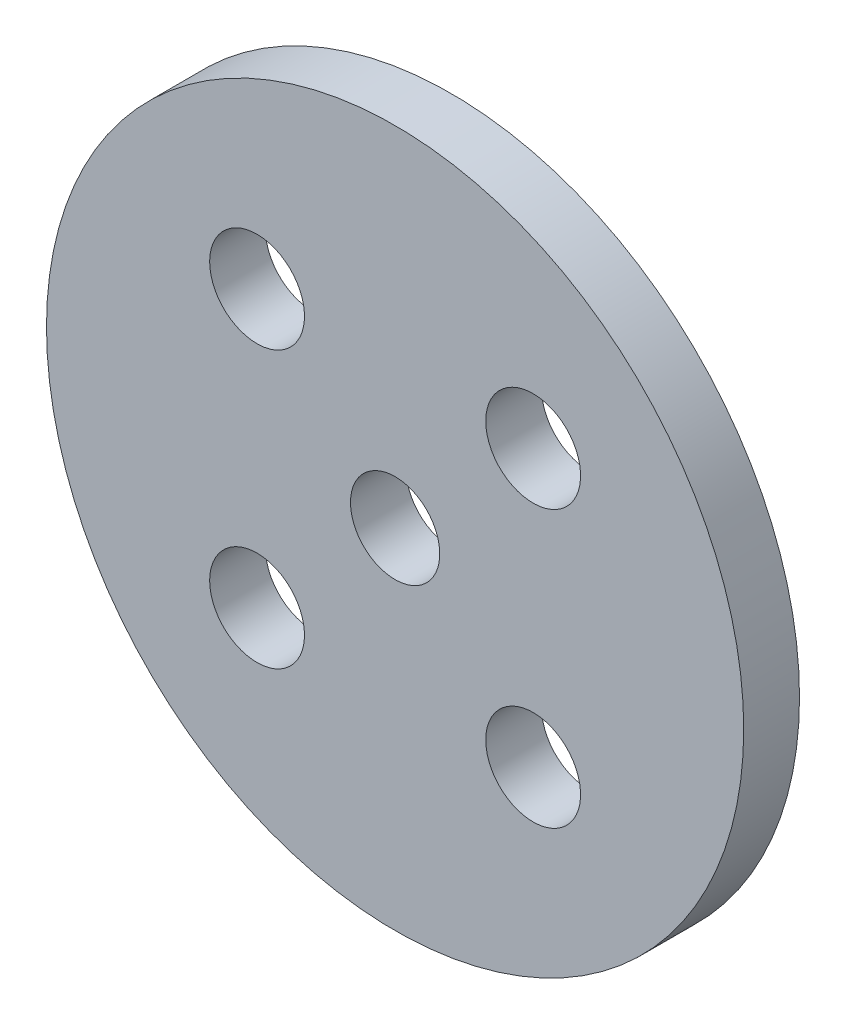
ISO-10303-21;
HEADER;
FILE_DESCRIPTION(('STEP AP214'),'2;1');
FILE_NAME('part.step','',(''),(''),'','','');
FILE_SCHEMA(('AUTOMOTIVE_DESIGN { 1 0 10303 214 1 1 1 1 }'));
ENDSEC;
DATA;
#1=APPLICATION_CONTEXT('core data for automotive mechanical design processes');
#2=APPLICATION_PROTOCOL_DEFINITION('international standard','automotive_design',2000,#1);
#3=PRODUCT_CONTEXT('',#1,'mechanical');
#4=PRODUCT('Part','Part','',(#3));
#5=PRODUCT_RELATED_PRODUCT_CATEGORY('part','',(#4));
#6=PRODUCT_DEFINITION_FORMATION('','',#4);
#7=PRODUCT_DEFINITION_CONTEXT('part definition',#1,'design');
#8=PRODUCT_DEFINITION('design','',#6,#7);
#9=PRODUCT_DEFINITION_SHAPE('','',#8);
#10=(LENGTH_UNIT() NAMED_UNIT(*) SI_UNIT(.MILLI.,.METRE.));
#11=(NAMED_UNIT(*) PLANE_ANGLE_UNIT() SI_UNIT($,.RADIAN.));
#12=(NAMED_UNIT(*) SI_UNIT($,.STERADIAN.) SOLID_ANGLE_UNIT());
#13=UNCERTAINTY_MEASURE_WITH_UNIT(LENGTH_MEASURE(1.E-05),#10,'distance_accuracy_value','');
#14=(GEOMETRIC_REPRESENTATION_CONTEXT(3) GLOBAL_UNCERTAINTY_ASSIGNED_CONTEXT((#13)) GLOBAL_UNIT_ASSIGNED_CONTEXT((#10,
#11,#12)) REPRESENTATION_CONTEXT('',''));
#15=CARTESIAN_POINT('',(0.,0.,0.));
#16=DIRECTION('',(0.,0.,1.));
#17=DIRECTION('',(1.,0.,0.));
#18=AXIS2_PLACEMENT_3D('',#15,#16,#17);
#19=CARTESIAN_POINT('',(1453.29186510434,480.003664233674,0.));
#20=DIRECTION('',(0.,0.,1.));
#21=DIRECTION('',(1.,0.,0.));
#22=AXIS2_PLACEMENT_3D('',#19,#20,#21);
#23=PLANE('',#22);
#24=CARTESIAN_POINT('',(1453.29186510434,480.003664233674,0.));
#25=DIRECTION('',(0.,0.,-1.));
#26=DIRECTION('',(1.,0.,0.));
#27=AXIS2_PLACEMENT_3D('',#24,#25,#26);
#28=CIRCLE('',#27,1.59999999999997);
#29=CARTESIAN_POINT('',(1451.69186510434,480.003664233674,0.));
#30=VERTEX_POINT('',#29);
#31=EDGE_CURVE('E134',#30,#30,#28,.T.);
#32=ORIENTED_EDGE('',*,*,#31,.F.);
#33=EDGE_LOOP('',(#32));
#34=FACE_BOUND('',#33,.T.);
#35=CARTESIAN_POINT('',(1458.24161115843,484.953410287769,0.));
#36=DIRECTION('',(0.,0.,-1.));
#37=DIRECTION('',(1.,0.,0.));
#38=AXIS2_PLACEMENT_3D('',#35,#36,#37);
#39=CIRCLE('',#38,1.69999999999987);
#40=CARTESIAN_POINT('',(1456.54161115843,484.953410287769,0.));
#41=VERTEX_POINT('',#40);
#42=EDGE_CURVE('E88',#41,#41,#39,.T.);
#43=ORIENTED_EDGE('',*,*,#42,.F.);
#44=EDGE_LOOP('',(#43));
#45=FACE_BOUND('',#44,.T.);
#46=CARTESIAN_POINT('',(1448.34211905024,475.053918179578,0.));
#47=DIRECTION('',(0.,0.,-1.));
#48=DIRECTION('',(1.,0.,0.));
#49=AXIS2_PLACEMENT_3D('',#46,#47,#48);
#50=CIRCLE('',#49,1.69999999999987);
#51=CARTESIAN_POINT('',(1446.64211905025,475.053918179578,0.));
#52=VERTEX_POINT('',#51);
#53=EDGE_CURVE('E106',#52,#52,#50,.T.);
#54=ORIENTED_EDGE('',*,*,#53,.F.);
#55=EDGE_LOOP('',(#54));
#56=FACE_BOUND('',#55,.T.);
#57=CARTESIAN_POINT('',(1448.34211905024,484.953410287769,0.));
#58=DIRECTION('',(0.,0.,-1.));
#59=DIRECTION('',(1.,0.,0.));
#60=AXIS2_PLACEMENT_3D('',#57,#58,#59);
#61=CIRCLE('',#60,1.69999999999987);
#62=CARTESIAN_POINT('',(1446.64211905025,484.953410287769,0.));
#63=VERTEX_POINT('',#62);
#64=EDGE_CURVE('E114',#63,#63,#61,.T.);
#65=ORIENTED_EDGE('',*,*,#64,.F.);
#66=EDGE_LOOP('',(#65));
#67=FACE_BOUND('',#66,.T.);
#68=CARTESIAN_POINT('',(1458.24161115843,475.053918179578,0.));
#69=DIRECTION('',(0.,0.,-1.));
#70=DIRECTION('',(1.,0.,0.));
#71=AXIS2_PLACEMENT_3D('',#68,#69,#70);
#72=CIRCLE('',#71,1.69999999999987);
#73=CARTESIAN_POINT('',(1456.54161115843,475.053918179578,0.));
#74=VERTEX_POINT('',#73);
#75=EDGE_CURVE('E127',#74,#74,#72,.T.);
#76=ORIENTED_EDGE('',*,*,#75,.F.);
#77=EDGE_LOOP('',(#76));
#78=FACE_BOUND('',#77,.T.);
#79=CARTESIAN_POINT('',(1453.29186510434,480.003664233674,0.));
#80=DIRECTION('',(0.,0.,1.));
#81=DIRECTION('',(1.,0.,0.));
#82=AXIS2_PLACEMENT_3D('',#79,#80,#81);
#83=CIRCLE('',#82,12.5);
#84=CARTESIAN_POINT('',(1440.79186510434,480.003664233674,0.));
#85=VERTEX_POINT('',#84);
#86=EDGE_CURVE('E11',#85,#85,#83,.T.);
#87=ORIENTED_EDGE('',*,*,#86,.F.);
#88=EDGE_LOOP('',(#87));
#89=FACE_BOUND('',#88,.T.);
#90=ADVANCED_FACE('F17',(#34,#45,#56,#67,#78,#89),#23,.F.);
#91=CARTESIAN_POINT('',(1453.29186510434,480.003664233674,2.));
#92=DIRECTION('',(0.,0.,1.));
#93=DIRECTION('',(1.,0.,0.));
#94=AXIS2_PLACEMENT_3D('',#91,#92,#93);
#95=PLANE('',#94);
#96=CARTESIAN_POINT('',(1453.29186510434,480.003664233674,2.));
#97=DIRECTION('',(0.,0.,-1.));
#98=DIRECTION('',(1.,0.,0.));
#99=AXIS2_PLACEMENT_3D('',#96,#97,#98);
#100=CIRCLE('',#99,1.59999999999997);
#101=CARTESIAN_POINT('',(1451.69186510434,480.003664233674,2.));
#102=VERTEX_POINT('',#101);
#103=EDGE_CURVE('E138',#102,#102,#100,.T.);
#104=ORIENTED_EDGE('',*,*,#103,.T.);
#105=EDGE_LOOP('',(#104));
#106=FACE_BOUND('',#105,.T.);
#107=CARTESIAN_POINT('',(1458.24161115843,484.953410287769,2.));
#108=DIRECTION('',(0.,0.,-1.));
#109=DIRECTION('',(1.,0.,0.));
#110=AXIS2_PLACEMENT_3D('',#107,#108,#109);
#111=CIRCLE('',#110,1.69999999999987);
#112=CARTESIAN_POINT('',(1456.54161115843,484.953410287769,2.));
#113=VERTEX_POINT('',#112);
#114=EDGE_CURVE('E103',#113,#113,#111,.T.);
#115=ORIENTED_EDGE('',*,*,#114,.T.);
#116=EDGE_LOOP('',(#115));
#117=FACE_BOUND('',#116,.T.);
#118=CARTESIAN_POINT('',(1448.34211905024,475.053918179578,2.));
#119=DIRECTION('',(0.,0.,-1.));
#120=DIRECTION('',(1.,0.,0.));
#121=AXIS2_PLACEMENT_3D('',#118,#119,#120);
#122=CIRCLE('',#121,1.69999999999987);
#123=CARTESIAN_POINT('',(1446.64211905025,475.053918179578,2.));
#124=VERTEX_POINT('',#123);
#125=EDGE_CURVE('E95',#124,#124,#122,.T.);
#126=ORIENTED_EDGE('',*,*,#125,.T.);
#127=EDGE_LOOP('',(#126));
#128=FACE_BOUND('',#127,.T.);
#129=CARTESIAN_POINT('',(1448.34211905024,484.953410287769,2.));
#130=DIRECTION('',(0.,0.,-1.));
#131=DIRECTION('',(1.,0.,0.));
#132=AXIS2_PLACEMENT_3D('',#129,#130,#131);
#133=CIRCLE('',#132,1.69999999999987);
#134=CARTESIAN_POINT('',(1446.64211905025,484.953410287769,2.));
#135=VERTEX_POINT('',#134);
#136=EDGE_CURVE('E109',#135,#135,#133,.T.);
#137=ORIENTED_EDGE('',*,*,#136,.T.);
#138=EDGE_LOOP('',(#137));
#139=FACE_BOUND('',#138,.T.);
#140=CARTESIAN_POINT('',(1458.24161115843,475.053918179578,2.));
#141=DIRECTION('',(0.,0.,-1.));
#142=DIRECTION('',(1.,0.,0.));
#143=AXIS2_PLACEMENT_3D('',#140,#141,#142);
#144=CIRCLE('',#143,1.69999999999987);
#145=CARTESIAN_POINT('',(1456.54161115843,475.053918179578,2.));
#146=VERTEX_POINT('',#145);
#147=EDGE_CURVE('E117',#146,#146,#144,.T.);
#148=ORIENTED_EDGE('',*,*,#147,.T.);
#149=EDGE_LOOP('',(#148));
#150=FACE_BOUND('',#149,.T.);
#151=CARTESIAN_POINT('',(1453.29186510434,480.003664233674,2.));
#152=DIRECTION('',(0.,0.,1.));
#153=DIRECTION('',(1.,0.,0.));
#154=AXIS2_PLACEMENT_3D('',#151,#152,#153);
#155=CIRCLE('',#154,12.5);
#156=CARTESIAN_POINT('',(1440.79186510434,480.003664233674,2.));
#157=VERTEX_POINT('',#156);
#158=EDGE_CURVE('E130',#157,#157,#155,.T.);
#159=ORIENTED_EDGE('',*,*,#158,.T.);
#160=EDGE_LOOP('',(#159));
#161=FACE_BOUND('',#160,.T.);
#162=ADVANCED_FACE('F19',(#106,#117,#128,#139,#150,#161),#95,.T.);
#163=CARTESIAN_POINT('',(1453.29186510434,480.003664233674,0.));
#164=DIRECTION('',(0.,0.,1.));
#165=DIRECTION('',(1.,0.,0.));
#166=AXIS2_PLACEMENT_3D('',#163,#164,#165);
#167=CYLINDRICAL_SURFACE('',#166,12.5);
#168=ORIENTED_EDGE('',*,*,#158,.F.);
#169=DIRECTION('',(0.,0.,-1.));
#170=VECTOR('',#169,1.);
#171=CARTESIAN_POINT('',(1440.79186510434,480.003664233674,0.));
#172=LINE('',#171,#170);
#173=EDGE_CURVE('E27',#157,#85,#172,.T.);
#174=ORIENTED_EDGE('',*,*,#173,.T.);
#175=ORIENTED_EDGE('',*,*,#86,.T.);
#176=ORIENTED_EDGE('',*,*,#173,.F.);
#177=EDGE_LOOP('',(#168,#174,#175,#176));
#178=FACE_BOUND('',#177,.T.);
#179=ADVANCED_FACE('F153',(#178),#167,.T.);
#180=CARTESIAN_POINT('',(1458.24161115843,475.053918179578,0.));
#181=DIRECTION('',(0.,0.,1.));
#182=DIRECTION('',(1.,0.,0.));
#183=AXIS2_PLACEMENT_3D('',#180,#181,#182);
#184=CYLINDRICAL_SURFACE('',#183,1.69999999999987);
#185=ORIENTED_EDGE('',*,*,#147,.F.);
#186=DIRECTION('',(0.,0.,-1.));
#187=VECTOR('',#186,1.);
#188=CARTESIAN_POINT('',(1456.54161115843,475.053918179578,0.));
#189=LINE('',#188,#187);
#190=EDGE_CURVE('E121',#146,#74,#189,.T.);
#191=ORIENTED_EDGE('',*,*,#190,.T.);
#192=ORIENTED_EDGE('',*,*,#75,.T.);
#193=ORIENTED_EDGE('',*,*,#190,.F.);
#194=EDGE_LOOP('',(#185,#191,#192,#193));
#195=FACE_BOUND('',#194,.T.);
#196=ADVANCED_FACE('F163',(#195),#184,.F.);
#197=CARTESIAN_POINT('',(1448.34211905024,484.953410287769,0.));
#198=DIRECTION('',(0.,0.,1.));
#199=DIRECTION('',(1.,0.,0.));
#200=AXIS2_PLACEMENT_3D('',#197,#198,#199);
#201=CYLINDRICAL_SURFACE('',#200,1.69999999999987);
#202=ORIENTED_EDGE('',*,*,#136,.F.);
#203=DIRECTION('',(0.,0.,-1.));
#204=VECTOR('',#203,1.);
#205=CARTESIAN_POINT('',(1446.64211905025,484.953410287769,0.));
#206=LINE('',#205,#204);
#207=EDGE_CURVE('E113',#135,#63,#206,.T.);
#208=ORIENTED_EDGE('',*,*,#207,.T.);
#209=ORIENTED_EDGE('',*,*,#64,.T.);
#210=ORIENTED_EDGE('',*,*,#207,.F.);
#211=EDGE_LOOP('',(#202,#208,#209,#210));
#212=FACE_BOUND('',#211,.T.);
#213=ADVANCED_FACE('F179',(#212),#201,.F.);
#214=CARTESIAN_POINT('',(1448.34211905024,475.053918179578,0.));
#215=DIRECTION('',(0.,0.,1.));
#216=DIRECTION('',(1.,0.,0.));
#217=AXIS2_PLACEMENT_3D('',#214,#215,#216);
#218=CYLINDRICAL_SURFACE('',#217,1.69999999999987);
#219=ORIENTED_EDGE('',*,*,#125,.F.);
#220=DIRECTION('',(0.,0.,-1.));
#221=VECTOR('',#220,1.);
#222=CARTESIAN_POINT('',(1446.64211905025,475.053918179578,0.));
#223=LINE('',#222,#221);
#224=EDGE_CURVE('E80',#124,#52,#223,.T.);
#225=ORIENTED_EDGE('',*,*,#224,.T.);
#226=ORIENTED_EDGE('',*,*,#53,.T.);
#227=ORIENTED_EDGE('',*,*,#224,.F.);
#228=EDGE_LOOP('',(#219,#225,#226,#227));
#229=FACE_BOUND('',#228,.T.);
#230=ADVANCED_FACE('F185',(#229),#218,.F.);
#231=CARTESIAN_POINT('',(1458.24161115843,484.953410287769,0.));
#232=DIRECTION('',(0.,0.,1.));
#233=DIRECTION('',(1.,0.,0.));
#234=AXIS2_PLACEMENT_3D('',#231,#232,#233);
#235=CYLINDRICAL_SURFACE('',#234,1.69999999999987);
#236=ORIENTED_EDGE('',*,*,#114,.F.);
#237=DIRECTION('',(0.,0.,-1.));
#238=VECTOR('',#237,1.);
#239=CARTESIAN_POINT('',(1456.54161115843,484.953410287769,0.));
#240=LINE('',#239,#238);
#241=EDGE_CURVE('E91',#113,#41,#240,.T.);
#242=ORIENTED_EDGE('',*,*,#241,.T.);
#243=ORIENTED_EDGE('',*,*,#42,.T.);
#244=ORIENTED_EDGE('',*,*,#241,.F.);
#245=EDGE_LOOP('',(#236,#242,#243,#244));
#246=FACE_BOUND('',#245,.T.);
#247=ADVANCED_FACE('F90',(#246),#235,.F.);
#248=CARTESIAN_POINT('',(1453.29186510434,480.003664233674,0.));
#249=DIRECTION('',(0.,0.,1.));
#250=DIRECTION('',(1.,0.,0.));
#251=AXIS2_PLACEMENT_3D('',#248,#249,#250);
#252=CYLINDRICAL_SURFACE('',#251,1.59999999999997);
#253=ORIENTED_EDGE('',*,*,#103,.F.);
#254=DIRECTION('',(0.,0.,-1.));
#255=VECTOR('',#254,1.);
#256=CARTESIAN_POINT('',(1451.69186510434,480.003664233674,0.));
#257=LINE('',#256,#255);
#258=EDGE_CURVE('E137',#102,#30,#257,.T.);
#259=ORIENTED_EDGE('',*,*,#258,.T.);
#260=ORIENTED_EDGE('',*,*,#31,.T.);
#261=ORIENTED_EDGE('',*,*,#258,.F.);
#262=EDGE_LOOP('',(#253,#259,#260,#261));
#263=FACE_BOUND('',#262,.T.);
#264=ADVANCED_FACE('F190',(#263),#252,.F.);
#265=CLOSED_SHELL('',(#90,#162,#179,#196,#213,#230,#247,#264));
#266=MANIFOLD_SOLID_BREP('B1',#265);
#267=ADVANCED_BREP_SHAPE_REPRESENTATION('',(#18,#266),#14);
#268=SHAPE_DEFINITION_REPRESENTATION(#9,#267);
ENDSEC;
END-ISO-10303-21;
